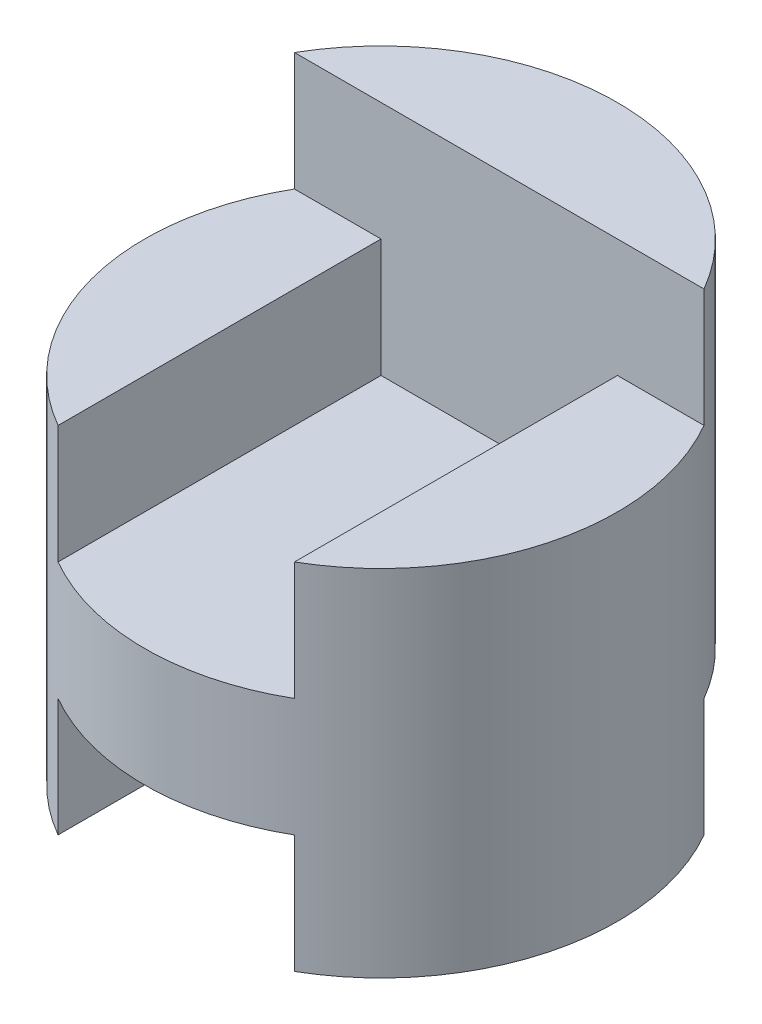
ISO-10303-21;
HEADER;
FILE_DESCRIPTION(('STEP AP214'),'2;1');
FILE_NAME('part.step','',(''),(''),'','','');
FILE_SCHEMA(('AUTOMOTIVE_DESIGN { 1 0 10303 214 1 1 1 1 }'));
ENDSEC;
DATA;
#1=APPLICATION_CONTEXT('core data for automotive mechanical design processes');
#2=APPLICATION_PROTOCOL_DEFINITION('international standard','automotive_design',2000,#1);
#3=PRODUCT_CONTEXT('',#1,'mechanical');
#4=PRODUCT('Part','Part','',(#3));
#5=PRODUCT_RELATED_PRODUCT_CATEGORY('part','',(#4));
#6=PRODUCT_DEFINITION_FORMATION('','',#4);
#7=PRODUCT_DEFINITION_CONTEXT('part definition',#1,'design');
#8=PRODUCT_DEFINITION('design','',#6,#7);
#9=PRODUCT_DEFINITION_SHAPE('','',#8);
#10=(LENGTH_UNIT() NAMED_UNIT(*) SI_UNIT(.MILLI.,.METRE.));
#11=(NAMED_UNIT(*) PLANE_ANGLE_UNIT() SI_UNIT($,.RADIAN.));
#12=(NAMED_UNIT(*) SI_UNIT($,.STERADIAN.) SOLID_ANGLE_UNIT());
#13=UNCERTAINTY_MEASURE_WITH_UNIT(LENGTH_MEASURE(1.E-05),#10,'distance_accuracy_value','');
#14=(GEOMETRIC_REPRESENTATION_CONTEXT(3) GLOBAL_UNCERTAINTY_ASSIGNED_CONTEXT((#13)) GLOBAL_UNIT_ASSIGNED_CONTEXT((#10,
#11,#12)) REPRESENTATION_CONTEXT('',''));
#15=CARTESIAN_POINT('',(0.,0.,0.));
#16=DIRECTION('',(0.,0.,1.));
#17=DIRECTION('',(1.,0.,0.));
#18=AXIS2_PLACEMENT_3D('',#15,#16,#17);
#19=CARTESIAN_POINT('',(0.,4.,0.));
#20=DIRECTION('',(0.,-1.,0.));
#21=DIRECTION('',(0.,0.,-1.));
#22=AXIS2_PLACEMENT_3D('',#19,#20,#21);
#23=CYLINDRICAL_SURFACE('',#22,2.);
#24=CARTESIAN_POINT('',(0.,0.,0.));
#25=DIRECTION('',(0.,1.,0.));
#26=DIRECTION('',(0.,0.,1.));
#27=AXIS2_PLACEMENT_3D('',#24,#25,#26);
#28=CIRCLE('',#27,2.);
#29=CARTESIAN_POINT('',(1.,0.,1.73205080756888));
#30=VERTEX_POINT('',#29);
#31=CARTESIAN_POINT('',(1.73205080756888,0.,-1.));
#32=VERTEX_POINT('',#31);
#33=EDGE_CURVE('E192',#30,#32,#28,.T.);
#34=ORIENTED_EDGE('',*,*,#33,.T.);
#35=DIRECTION('',(0.,-1.,0.));
#36=VECTOR('',#35,1.);
#37=CARTESIAN_POINT('',(1.73205080756888,4.,-1.));
#38=LINE('',#37,#36);
#39=CARTESIAN_POINT('',(1.73205080756888,1.,-1.));
#40=VERTEX_POINT('',#39);
#41=EDGE_CURVE('E128',#32,#40,#38,.F.);
#42=ORIENTED_EDGE('',*,*,#41,.T.);
#43=CARTESIAN_POINT('',(0.,1.,0.));
#44=DIRECTION('',(0.,1.,0.));
#45=DIRECTION('',(-1.,0.,0.));
#46=AXIS2_PLACEMENT_3D('',#43,#44,#45);
#47=CIRCLE('',#46,2.);
#48=CARTESIAN_POINT('',(-1.73205080756888,1.,-1.));
#49=VERTEX_POINT('',#48);
#50=EDGE_CURVE('E122',#40,#49,#47,.T.);
#51=ORIENTED_EDGE('',*,*,#50,.T.);
#52=DIRECTION('',(0.,-1.,0.));
#53=VECTOR('',#52,1.);
#54=CARTESIAN_POINT('',(-1.73205080756888,4.,-1.));
#55=LINE('',#54,#53);
#56=CARTESIAN_POINT('',(-1.73205080756888,0.,-1.));
#57=VERTEX_POINT('',#56);
#58=EDGE_CURVE('E126',#49,#57,#55,.T.);
#59=ORIENTED_EDGE('',*,*,#58,.T.);
#60=CARTESIAN_POINT('',(-1.,0.,1.73205080756888));
#61=VERTEX_POINT('',#60);
#62=EDGE_CURVE('E187',#57,#61,#28,.T.);
#63=ORIENTED_EDGE('',*,*,#62,.T.);
#64=DIRECTION('',(0.,-1.,0.));
#65=VECTOR('',#64,1.);
#66=CARTESIAN_POINT('',(-1.,4.,1.73205080756888));
#67=LINE('',#66,#65);
#68=CARTESIAN_POINT('',(-1.,1.,1.73205080756888));
#69=VERTEX_POINT('',#68);
#70=EDGE_CURVE('E184',#61,#69,#67,.F.);
#71=ORIENTED_EDGE('',*,*,#70,.T.);
#72=CARTESIAN_POINT('',(1.,1.,1.73205080756888));
#73=VERTEX_POINT('',#72);
#74=EDGE_CURVE('E131',#69,#73,#47,.T.);
#75=ORIENTED_EDGE('',*,*,#74,.T.);
#76=DIRECTION('',(0.,-1.,0.));
#77=VECTOR('',#76,1.);
#78=CARTESIAN_POINT('',(1.,4.,1.73205080756888));
#79=LINE('',#78,#77);
#80=EDGE_CURVE('E180',#73,#30,#79,.T.);
#81=ORIENTED_EDGE('',*,*,#80,.T.);
#82=EDGE_LOOP('',(#34,#42,#51,#59,#63,#71,#75,#81));
#83=FACE_BOUND('',#82,.T.);
#84=DIRECTION('',(0.,-1.,0.));
#85=VECTOR('',#84,1.);
#86=CARTESIAN_POINT('',(-1.,4.,1.73205080756888));
#87=LINE('',#86,#85);
#88=CARTESIAN_POINT('',(-1.,3.,1.73205080756888));
#89=VERTEX_POINT('',#88);
#90=CARTESIAN_POINT('',(-1.,2.,1.73205080756888));
#91=VERTEX_POINT('',#90);
#92=EDGE_CURVE('E40',#89,#91,#87,.T.);
#93=ORIENTED_EDGE('',*,*,#92,.F.);
#94=CARTESIAN_POINT('',(0.,3.,0.));
#95=DIRECTION('',(0.,1.,0.));
#96=DIRECTION('',(0.,0.,1.));
#97=AXIS2_PLACEMENT_3D('',#94,#95,#96);
#98=CIRCLE('',#97,2.);
#99=CARTESIAN_POINT('',(-1.73205080756888,3.,-1.));
#100=VERTEX_POINT('',#99);
#101=EDGE_CURVE('E201',#100,#89,#98,.T.);
#102=ORIENTED_EDGE('',*,*,#101,.F.);
#103=DIRECTION('',(0.,-1.,0.));
#104=VECTOR('',#103,1.);
#105=CARTESIAN_POINT('',(-1.73205080756888,4.,-1.));
#106=LINE('',#105,#104);
#107=CARTESIAN_POINT('',(-1.73205080756888,4.,-1.));
#108=VERTEX_POINT('',#107);
#109=EDGE_CURVE('E174',#100,#108,#106,.F.);
#110=ORIENTED_EDGE('',*,*,#109,.T.);
#111=CARTESIAN_POINT('',(0.,4.,0.));
#112=DIRECTION('',(0.,1.,0.));
#113=DIRECTION('',(0.,0.,1.));
#114=AXIS2_PLACEMENT_3D('',#111,#112,#113);
#115=CIRCLE('',#114,2.);
#116=CARTESIAN_POINT('',(1.73205080756888,4.,-1.));
#117=VERTEX_POINT('',#116);
#118=EDGE_CURVE('E188',#117,#108,#115,.T.);
#119=ORIENTED_EDGE('',*,*,#118,.F.);
#120=DIRECTION('',(0.,-1.,0.));
#121=VECTOR('',#120,1.);
#122=CARTESIAN_POINT('',(1.73205080756888,4.,-1.));
#123=LINE('',#122,#121);
#124=CARTESIAN_POINT('',(1.73205080756888,3.,-1.));
#125=VERTEX_POINT('',#124);
#126=EDGE_CURVE('E55',#117,#125,#123,.T.);
#127=ORIENTED_EDGE('',*,*,#126,.T.);
#128=CARTESIAN_POINT('',(0.,3.,0.));
#129=DIRECTION('',(0.,1.,0.));
#130=DIRECTION('',(-1.,0.,0.));
#131=AXIS2_PLACEMENT_3D('',#128,#129,#130);
#132=CIRCLE('',#131,2.);
#133=CARTESIAN_POINT('',(1.,3.,1.73205080756888));
#134=VERTEX_POINT('',#133);
#135=EDGE_CURVE('E203',#134,#125,#132,.T.);
#136=ORIENTED_EDGE('',*,*,#135,.F.);
#137=DIRECTION('',(0.,-1.,0.));
#138=VECTOR('',#137,1.);
#139=CARTESIAN_POINT('',(1.,4.,1.73205080756888));
#140=LINE('',#139,#138);
#141=CARTESIAN_POINT('',(1.,2.,1.73205080756888));
#142=VERTEX_POINT('',#141);
#143=EDGE_CURVE('E205',#142,#134,#140,.F.);
#144=ORIENTED_EDGE('',*,*,#143,.F.);
#145=CARTESIAN_POINT('',(0.,2.,0.));
#146=DIRECTION('',(0.,1.,0.));
#147=DIRECTION('',(-1.,0.,0.));
#148=AXIS2_PLACEMENT_3D('',#145,#146,#147);
#149=CIRCLE('',#148,2.);
#150=EDGE_CURVE('E208',#91,#142,#149,.T.);
#151=ORIENTED_EDGE('',*,*,#150,.F.);
#152=EDGE_LOOP('',(#93,#102,#110,#119,#127,#136,#144,#151));
#153=FACE_BOUND('',#152,.T.);
#154=ADVANCED_FACE('F33',(#83,#153),#23,.T.);
#155=CARTESIAN_POINT('',(0.,0.,0.));
#156=DIRECTION('',(0.,1.,0.));
#157=DIRECTION('',(0.,0.,1.));
#158=AXIS2_PLACEMENT_3D('',#155,#156,#157);
#159=PLANE('',#158);
#160=ORIENTED_EDGE('',*,*,#62,.F.);
#161=DIRECTION('',(1.,0.,0.));
#162=VECTOR('',#161,1.);
#163=CARTESIAN_POINT('',(-5.,0.,-1.));
#164=LINE('',#163,#162);
#165=CARTESIAN_POINT('',(-1.,0.,-1.));
#166=VERTEX_POINT('',#165);
#167=EDGE_CURVE('E138',#57,#166,#164,.T.);
#168=ORIENTED_EDGE('',*,*,#167,.T.);
#169=DIRECTION('',(0.,0.,1.));
#170=VECTOR('',#169,1.);
#171=CARTESIAN_POINT('',(-1.,0.,0.));
#172=LINE('',#171,#170);
#173=EDGE_CURVE('E196',#166,#61,#172,.T.);
#174=ORIENTED_EDGE('',*,*,#173,.T.);
#175=EDGE_LOOP('',(#160,#168,#174));
#176=FACE_BOUND('',#175,.T.);
#177=ADVANCED_FACE('F238',(#176),#159,.F.);
#178=CARTESIAN_POINT('',(0.,4.,0.));
#179=DIRECTION('',(0.,1.,0.));
#180=DIRECTION('',(0.,0.,1.));
#181=AXIS2_PLACEMENT_3D('',#178,#179,#180);
#182=PLANE('',#181);
#183=DIRECTION('',(-1.,0.,0.));
#184=VECTOR('',#183,1.);
#185=CARTESIAN_POINT('',(0.,4.,-1.));
#186=LINE('',#185,#184);
#187=EDGE_CURVE('E130',#117,#108,#186,.T.);
#188=ORIENTED_EDGE('',*,*,#187,.F.);
#189=ORIENTED_EDGE('',*,*,#118,.T.);
#190=EDGE_LOOP('',(#188,#189));
#191=FACE_BOUND('',#190,.T.);
#192=ADVANCED_FACE('F235',(#191),#182,.T.);
#193=DIRECTION('',(0.,0.,-1.));
#194=VECTOR('',#193,1.);
#195=CARTESIAN_POINT('',(1.,0.,0.));
#196=LINE('',#195,#194);
#197=CARTESIAN_POINT('',(1.,0.,-1.));
#198=VERTEX_POINT('',#197);
#199=EDGE_CURVE('E191',#30,#198,#196,.T.);
#200=ORIENTED_EDGE('',*,*,#199,.T.);
#201=EDGE_CURVE('E145',#198,#32,#164,.T.);
#202=ORIENTED_EDGE('',*,*,#201,.T.);
#203=ORIENTED_EDGE('',*,*,#33,.F.);
#204=EDGE_LOOP('',(#200,#202,#203));
#205=FACE_BOUND('',#204,.T.);
#206=ADVANCED_FACE('F237',(#205),#159,.F.);
#207=CARTESIAN_POINT('',(-1.,1.,-2.));
#208=DIRECTION('',(0.,1.,0.));
#209=DIRECTION('',(-1.,0.,0.));
#210=AXIS2_PLACEMENT_3D('',#207,#208,#209);
#211=PLANE('',#210);
#212=DIRECTION('',(0.,0.,1.));
#213=VECTOR('',#212,1.);
#214=CARTESIAN_POINT('',(-1.,1.,-2.));
#215=LINE('',#214,#213);
#216=CARTESIAN_POINT('',(-1.,1.,-1.));
#217=VERTEX_POINT('',#216);
#218=EDGE_CURVE('E144',#217,#69,#215,.T.);
#219=ORIENTED_EDGE('',*,*,#218,.F.);
#220=DIRECTION('',(1.,0.,0.));
#221=VECTOR('',#220,1.);
#222=CARTESIAN_POINT('',(-5.,1.,-1.));
#223=LINE('',#222,#221);
#224=EDGE_CURVE('E135',#49,#217,#223,.T.);
#225=ORIENTED_EDGE('',*,*,#224,.F.);
#226=ORIENTED_EDGE('',*,*,#50,.F.);
#227=CARTESIAN_POINT('',(1.,1.,-1.));
#228=VERTEX_POINT('',#227);
#229=EDGE_CURVE('E47',#228,#40,#223,.T.);
#230=ORIENTED_EDGE('',*,*,#229,.F.);
#231=DIRECTION('',(0.,0.,1.));
#232=VECTOR('',#231,1.);
#233=CARTESIAN_POINT('',(1.,1.,-2.));
#234=LINE('',#233,#232);
#235=EDGE_CURVE('E178',#228,#73,#234,.T.);
#236=ORIENTED_EDGE('',*,*,#235,.T.);
#237=ORIENTED_EDGE('',*,*,#74,.F.);
#238=EDGE_LOOP('',(#219,#225,#226,#230,#236,#237));
#239=FACE_BOUND('',#238,.T.);
#240=ADVANCED_FACE('F142',(#239),#211,.F.);
#241=CARTESIAN_POINT('',(-1.,0.,-2.));
#242=DIRECTION('',(-1.,0.,0.));
#243=DIRECTION('',(0.,0.,1.));
#244=AXIS2_PLACEMENT_3D('',#241,#242,#243);
#245=PLANE('',#244);
#246=ORIENTED_EDGE('',*,*,#173,.F.);
#247=DIRECTION('',(0.,1.,0.));
#248=VECTOR('',#247,1.);
#249=CARTESIAN_POINT('',(-1.,0.,-1.));
#250=LINE('',#249,#248);
#251=EDGE_CURVE('E150',#166,#217,#250,.T.);
#252=ORIENTED_EDGE('',*,*,#251,.T.);
#253=ORIENTED_EDGE('',*,*,#218,.T.);
#254=ORIENTED_EDGE('',*,*,#70,.F.);
#255=EDGE_LOOP('',(#246,#252,#253,#254));
#256=FACE_BOUND('',#255,.T.);
#257=ADVANCED_FACE('F272',(#256),#245,.F.);
#258=CARTESIAN_POINT('',(1.,0.,-2.));
#259=DIRECTION('',(1.,0.,0.));
#260=DIRECTION('',(0.,0.,-1.));
#261=AXIS2_PLACEMENT_3D('',#258,#259,#260);
#262=PLANE('',#261);
#263=ORIENTED_EDGE('',*,*,#235,.F.);
#264=DIRECTION('',(0.,-1.,0.));
#265=VECTOR('',#264,1.);
#266=CARTESIAN_POINT('',(1.,0.,-1.));
#267=LINE('',#266,#265);
#268=EDGE_CURVE('E11',#228,#198,#267,.T.);
#269=ORIENTED_EDGE('',*,*,#268,.T.);
#270=ORIENTED_EDGE('',*,*,#199,.F.);
#271=ORIENTED_EDGE('',*,*,#80,.F.);
#272=EDGE_LOOP('',(#263,#269,#270,#271));
#273=FACE_BOUND('',#272,.T.);
#274=ADVANCED_FACE('F283',(#273),#262,.F.);
#275=CARTESIAN_POINT('',(-1.,3.,4.));
#276=DIRECTION('',(0.,1.,0.));
#277=DIRECTION('',(0.,0.,1.));
#278=AXIS2_PLACEMENT_3D('',#275,#276,#277);
#279=PLANE('',#278);
#280=ORIENTED_EDGE('',*,*,#101,.T.);
#281=DIRECTION('',(0.,0.,-1.));
#282=VECTOR('',#281,1.);
#283=CARTESIAN_POINT('',(-1.,3.,4.));
#284=LINE('',#283,#282);
#285=CARTESIAN_POINT('',(-1.,3.,-1.));
#286=VERTEX_POINT('',#285);
#287=EDGE_CURVE('E172',#89,#286,#284,.T.);
#288=ORIENTED_EDGE('',*,*,#287,.T.);
#289=DIRECTION('',(1.,0.,0.));
#290=VECTOR('',#289,1.);
#291=CARTESIAN_POINT('',(-1.,3.,-1.));
#292=LINE('',#291,#290);
#293=EDGE_CURVE('E139',#100,#286,#292,.T.);
#294=ORIENTED_EDGE('',*,*,#293,.F.);
#295=EDGE_LOOP('',(#280,#288,#294));
#296=FACE_BOUND('',#295,.T.);
#297=ADVANCED_FACE('F232',(#296),#279,.T.);
#298=CARTESIAN_POINT('',(-1.,2.,4.));
#299=DIRECTION('',(1.,0.,0.));
#300=DIRECTION('',(0.,0.,-1.));
#301=AXIS2_PLACEMENT_3D('',#298,#299,#300);
#302=PLANE('',#301);
#303=ORIENTED_EDGE('',*,*,#92,.T.);
#304=DIRECTION('',(0.,0.,-1.));
#305=VECTOR('',#304,1.);
#306=CARTESIAN_POINT('',(-1.,2.,4.));
#307=LINE('',#306,#305);
#308=CARTESIAN_POINT('',(-1.,2.,-1.));
#309=VERTEX_POINT('',#308);
#310=EDGE_CURVE('E170',#91,#309,#307,.T.);
#311=ORIENTED_EDGE('',*,*,#310,.T.);
#312=DIRECTION('',(0.,-1.,0.));
#313=VECTOR('',#312,1.);
#314=CARTESIAN_POINT('',(-1.,2.,-1.));
#315=LINE('',#314,#313);
#316=EDGE_CURVE('E155',#286,#309,#315,.T.);
#317=ORIENTED_EDGE('',*,*,#316,.F.);
#318=ORIENTED_EDGE('',*,*,#287,.F.);
#319=EDGE_LOOP('',(#303,#311,#317,#318));
#320=FACE_BOUND('',#319,.T.);
#321=ADVANCED_FACE('F213',(#320),#302,.T.);
#322=CARTESIAN_POINT('',(1.,2.,4.));
#323=DIRECTION('',(0.,1.,0.));
#324=DIRECTION('',(-1.,0.,0.));
#325=AXIS2_PLACEMENT_3D('',#322,#323,#324);
#326=PLANE('',#325);
#327=ORIENTED_EDGE('',*,*,#150,.T.);
#328=DIRECTION('',(0.,0.,-1.));
#329=VECTOR('',#328,1.);
#330=CARTESIAN_POINT('',(1.,2.,4.));
#331=LINE('',#330,#329);
#332=CARTESIAN_POINT('',(1.,2.,-1.));
#333=VERTEX_POINT('',#332);
#334=EDGE_CURVE('E168',#142,#333,#331,.T.);
#335=ORIENTED_EDGE('',*,*,#334,.T.);
#336=DIRECTION('',(1.,0.,0.));
#337=VECTOR('',#336,1.);
#338=CARTESIAN_POINT('',(1.,2.,-1.));
#339=LINE('',#338,#337);
#340=EDGE_CURVE('E158',#309,#333,#339,.T.);
#341=ORIENTED_EDGE('',*,*,#340,.F.);
#342=ORIENTED_EDGE('',*,*,#310,.F.);
#343=EDGE_LOOP('',(#327,#335,#341,#342));
#344=FACE_BOUND('',#343,.T.);
#345=ADVANCED_FACE('F219',(#344),#326,.T.);
#346=CARTESIAN_POINT('',(1.,3.,4.));
#347=DIRECTION('',(-1.,0.,0.));
#348=DIRECTION('',(0.,-1.,0.));
#349=AXIS2_PLACEMENT_3D('',#346,#347,#348);
#350=PLANE('',#349);
#351=ORIENTED_EDGE('',*,*,#143,.T.);
#352=DIRECTION('',(0.,0.,-1.));
#353=VECTOR('',#352,1.);
#354=CARTESIAN_POINT('',(1.,3.,4.));
#355=LINE('',#354,#353);
#356=CARTESIAN_POINT('',(1.,3.,-1.));
#357=VERTEX_POINT('',#356);
#358=EDGE_CURVE('E166',#134,#357,#355,.T.);
#359=ORIENTED_EDGE('',*,*,#358,.T.);
#360=DIRECTION('',(0.,1.,0.));
#361=VECTOR('',#360,1.);
#362=CARTESIAN_POINT('',(1.,3.,-1.));
#363=LINE('',#362,#361);
#364=EDGE_CURVE('E161',#333,#357,#363,.T.);
#365=ORIENTED_EDGE('',*,*,#364,.F.);
#366=ORIENTED_EDGE('',*,*,#334,.F.);
#367=EDGE_LOOP('',(#351,#359,#365,#366));
#368=FACE_BOUND('',#367,.T.);
#369=ADVANCED_FACE('F224',(#368),#350,.T.);
#370=CARTESIAN_POINT('',(2.,3.,4.));
#371=DIRECTION('',(0.,1.,0.));
#372=DIRECTION('',(-1.,0.,0.));
#373=AXIS2_PLACEMENT_3D('',#370,#371,#372);
#374=PLANE('',#373);
#375=ORIENTED_EDGE('',*,*,#358,.F.);
#376=ORIENTED_EDGE('',*,*,#135,.T.);
#377=DIRECTION('',(1.,0.,0.));
#378=VECTOR('',#377,1.);
#379=CARTESIAN_POINT('',(2.,3.,-1.));
#380=LINE('',#379,#378);
#381=EDGE_CURVE('E164',#357,#125,#380,.T.);
#382=ORIENTED_EDGE('',*,*,#381,.F.);
#383=EDGE_LOOP('',(#375,#376,#382));
#384=FACE_BOUND('',#383,.T.);
#385=ADVANCED_FACE('F228',(#384),#374,.T.);
#386=CARTESIAN_POINT('',(0.,0.,-1.));
#387=DIRECTION('',(0.,0.,-1.));
#388=DIRECTION('',(-1.,0.,0.));
#389=AXIS2_PLACEMENT_3D('',#386,#387,#388);
#390=PLANE('',#389);
#391=ORIENTED_EDGE('',*,*,#187,.T.);
#392=ORIENTED_EDGE('',*,*,#109,.F.);
#393=ORIENTED_EDGE('',*,*,#293,.T.);
#394=ORIENTED_EDGE('',*,*,#316,.T.);
#395=ORIENTED_EDGE('',*,*,#340,.T.);
#396=ORIENTED_EDGE('',*,*,#364,.T.);
#397=ORIENTED_EDGE('',*,*,#381,.T.);
#398=ORIENTED_EDGE('',*,*,#126,.F.);
#399=EDGE_LOOP('',(#391,#392,#393,#394,#395,#396,#397,#398));
#400=FACE_BOUND('',#399,.T.);
#401=ADVANCED_FACE('F229',(#400),#390,.F.);
#402=CARTESIAN_POINT('',(-5.,0.,-1.));
#403=DIRECTION('',(0.,0.,1.));
#404=DIRECTION('',(0.,-1.,0.));
#405=AXIS2_PLACEMENT_3D('',#402,#403,#404);
#406=PLANE('',#405);
#407=ORIENTED_EDGE('',*,*,#201,.F.);
#408=ORIENTED_EDGE('',*,*,#268,.F.);
#409=ORIENTED_EDGE('',*,*,#229,.T.);
#410=ORIENTED_EDGE('',*,*,#41,.F.);
#411=EDGE_LOOP('',(#407,#408,#409,#410));
#412=FACE_BOUND('',#411,.T.);
#413=ADVANCED_FACE('F298',(#412),#406,.F.);
#414=ORIENTED_EDGE('',*,*,#224,.T.);
#415=ORIENTED_EDGE('',*,*,#251,.F.);
#416=ORIENTED_EDGE('',*,*,#167,.F.);
#417=ORIENTED_EDGE('',*,*,#58,.F.);
#418=EDGE_LOOP('',(#414,#415,#416,#417));
#419=FACE_BOUND('',#418,.T.);
#420=ADVANCED_FACE('F134',(#419),#406,.F.);
#421=CLOSED_SHELL('',(#154,#177,#192,#206,#240,#257,#274,#297,#321,#345,#369,#385,#401,#413,#420));
#422=MANIFOLD_SOLID_BREP('B2',#421);
#423=ADVANCED_BREP_SHAPE_REPRESENTATION('',(#18,#422),#14);
#424=SHAPE_DEFINITION_REPRESENTATION(#9,#423);
ENDSEC;
END-ISO-10303-21;
